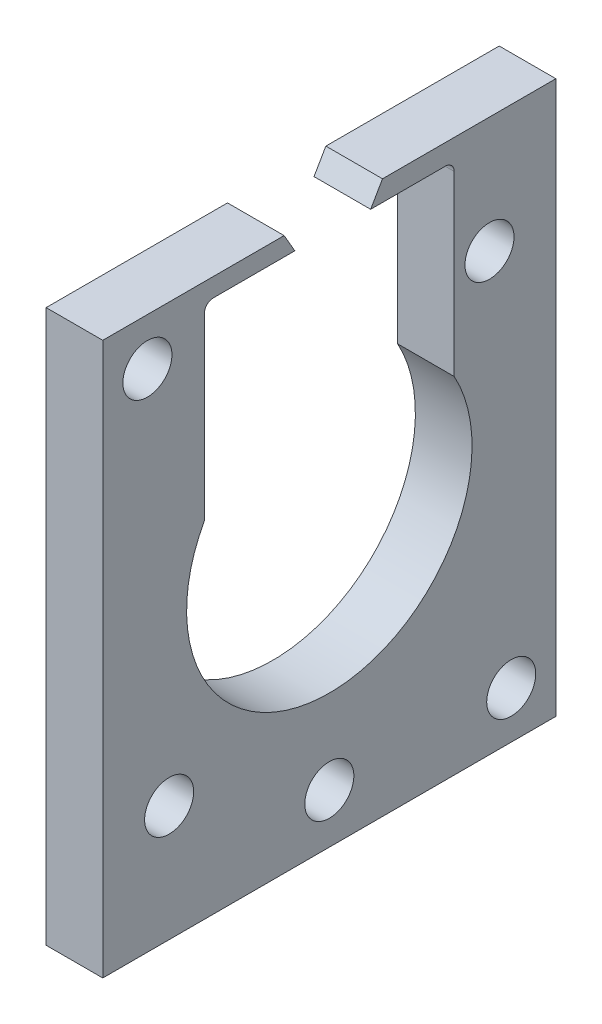
ISO-10303-21;
HEADER;
FILE_DESCRIPTION(('STEP AP214'),'2;1');
FILE_NAME('part.step','',(''),(''),'','','');
FILE_SCHEMA(('AUTOMOTIVE_DESIGN { 1 0 10303 214 1 1 1 1 }'));
ENDSEC;
DATA;
#1=APPLICATION_CONTEXT('core data for automotive mechanical design processes');
#2=APPLICATION_PROTOCOL_DEFINITION('international standard','automotive_design',2000,#1);
#3=PRODUCT_CONTEXT('',#1,'mechanical');
#4=PRODUCT('Part','Part','',(#3));
#5=PRODUCT_RELATED_PRODUCT_CATEGORY('part','',(#4));
#6=PRODUCT_DEFINITION_FORMATION('','',#4);
#7=PRODUCT_DEFINITION_CONTEXT('part definition',#1,'design');
#8=PRODUCT_DEFINITION('design','',#6,#7);
#9=PRODUCT_DEFINITION_SHAPE('','',#8);
#10=(LENGTH_UNIT() NAMED_UNIT(*) SI_UNIT(.MILLI.,.METRE.));
#11=(NAMED_UNIT(*) PLANE_ANGLE_UNIT() SI_UNIT($,.RADIAN.));
#12=(NAMED_UNIT(*) SI_UNIT($,.STERADIAN.) SOLID_ANGLE_UNIT());
#13=UNCERTAINTY_MEASURE_WITH_UNIT(LENGTH_MEASURE(1.E-05),#10,'distance_accuracy_value','');
#14=(GEOMETRIC_REPRESENTATION_CONTEXT(3) GLOBAL_UNCERTAINTY_ASSIGNED_CONTEXT((#13)) GLOBAL_UNIT_ASSIGNED_CONTEXT((#10,
#11,#12)) REPRESENTATION_CONTEXT('',''));
#15=CARTESIAN_POINT('',(0.,0.,0.));
#16=DIRECTION('',(0.,0.,1.));
#17=DIRECTION('',(1.,0.,0.));
#18=AXIS2_PLACEMENT_3D('',#15,#16,#17);
#19=CARTESIAN_POINT('',(6.35,61.92,0.));
#20=DIRECTION('',(0.,-1.,0.));
#21=DIRECTION('',(0.,0.,-1.));
#22=AXIS2_PLACEMENT_3D('',#19,#20,#21);
#23=PLANE('',#22);
#24=DIRECTION('',(0.,0.,1.));
#25=VECTOR('',#24,1.);
#26=CARTESIAN_POINT('',(6.35,61.92,0.));
#27=LINE('',#26,#25);
#28=CARTESIAN_POINT('',(6.35,61.92,-20.3333651982404));
#29=VERTEX_POINT('',#28);
#30=CARTESIAN_POINT('',(6.35,61.92,0.));
#31=VERTEX_POINT('',#30);
#32=EDGE_CURVE('E208',#29,#31,#27,.T.);
#33=ORIENTED_EDGE('',*,*,#32,.F.);
#34=DIRECTION('',(-1.,0.,0.));
#35=VECTOR('',#34,1.);
#36=CARTESIAN_POINT('',(6.35,61.92,-20.3333651982404));
#37=LINE('',#36,#35);
#38=CARTESIAN_POINT('',(0.,61.92,-20.3333651982404));
#39=VERTEX_POINT('',#38);
#40=EDGE_CURVE('E190',#29,#39,#37,.T.);
#41=ORIENTED_EDGE('',*,*,#40,.T.);
#42=DIRECTION('',(0.,0.,1.));
#43=VECTOR('',#42,1.);
#44=CARTESIAN_POINT('',(0.,61.92,0.));
#45=LINE('',#44,#43);
#46=CARTESIAN_POINT('',(0.,61.92,0.));
#47=VERTEX_POINT('',#46);
#48=EDGE_CURVE('E219',#39,#47,#45,.T.);
#49=ORIENTED_EDGE('',*,*,#48,.T.);
#50=DIRECTION('',(-1.,0.,0.));
#51=VECTOR('',#50,1.);
#52=CARTESIAN_POINT('',(6.35,61.92,0.));
#53=LINE('',#52,#51);
#54=EDGE_CURVE('E212',#31,#47,#53,.T.);
#55=ORIENTED_EDGE('',*,*,#54,.F.);
#56=EDGE_LOOP('',(#33,#41,#49,#55));
#57=FACE_BOUND('',#56,.T.);
#58=ADVANCED_FACE('F39',(#57),#23,.F.);
#59=CARTESIAN_POINT('',(6.35,0.,0.));
#60=DIRECTION('',(0.,0.,-1.));
#61=DIRECTION('',(-1.,0.,0.));
#62=AXIS2_PLACEMENT_3D('',#59,#60,#61);
#63=PLANE('',#62);
#64=DIRECTION('',(0.,-1.,0.));
#65=VECTOR('',#64,1.);
#66=CARTESIAN_POINT('',(0.,0.,0.));
#67=LINE('',#66,#65);
#68=CARTESIAN_POINT('',(0.,0.,0.));
#69=VERTEX_POINT('',#68);
#70=EDGE_CURVE('E197',#47,#69,#67,.T.);
#71=ORIENTED_EDGE('',*,*,#70,.T.);
#72=DIRECTION('',(-1.,0.,0.));
#73=VECTOR('',#72,1.);
#74=CARTESIAN_POINT('',(6.35,0.,0.));
#75=LINE('',#74,#73);
#76=CARTESIAN_POINT('',(6.35,0.,0.));
#77=VERTEX_POINT('',#76);
#78=EDGE_CURVE('E229',#77,#69,#75,.T.);
#79=ORIENTED_EDGE('',*,*,#78,.F.);
#80=DIRECTION('',(0.,-1.,0.));
#81=VECTOR('',#80,1.);
#82=CARTESIAN_POINT('',(6.35,0.,0.));
#83=LINE('',#82,#81);
#84=EDGE_CURVE('E200',#31,#77,#83,.T.);
#85=ORIENTED_EDGE('',*,*,#84,.F.);
#86=ORIENTED_EDGE('',*,*,#54,.T.);
#87=EDGE_LOOP('',(#71,#79,#85,#86));
#88=FACE_BOUND('',#87,.T.);
#89=ADVANCED_FACE('F269',(#88),#63,.F.);
#90=CARTESIAN_POINT('',(6.35,0.,0.));
#91=DIRECTION('',(0.,1.,0.));
#92=DIRECTION('',(0.,0.,1.));
#93=AXIS2_PLACEMENT_3D('',#90,#91,#92);
#94=PLANE('',#93);
#95=DIRECTION('',(0.,0.,-1.));
#96=VECTOR('',#95,1.);
#97=CARTESIAN_POINT('',(0.,0.,0.));
#98=LINE('',#97,#96);
#99=CARTESIAN_POINT('',(0.,0.,-50.8));
#100=VERTEX_POINT('',#99);
#101=EDGE_CURVE('E215',#69,#100,#98,.T.);
#102=ORIENTED_EDGE('',*,*,#101,.T.);
#103=DIRECTION('',(-1.,0.,0.));
#104=VECTOR('',#103,1.);
#105=CARTESIAN_POINT('',(6.35,0.,-50.8));
#106=LINE('',#105,#104);
#107=CARTESIAN_POINT('',(6.35,0.,-50.8));
#108=VERTEX_POINT('',#107);
#109=EDGE_CURVE('E226',#108,#100,#106,.T.);
#110=ORIENTED_EDGE('',*,*,#109,.F.);
#111=DIRECTION('',(0.,0.,-1.));
#112=VECTOR('',#111,1.);
#113=CARTESIAN_POINT('',(6.35,0.,0.));
#114=LINE('',#113,#112);
#115=EDGE_CURVE('E203',#77,#108,#114,.T.);
#116=ORIENTED_EDGE('',*,*,#115,.F.);
#117=ORIENTED_EDGE('',*,*,#78,.T.);
#118=EDGE_LOOP('',(#102,#110,#116,#117));
#119=FACE_BOUND('',#118,.T.);
#120=ADVANCED_FACE('F278',(#119),#94,.F.);
#121=CARTESIAN_POINT('',(6.35,0.,-50.8));
#122=DIRECTION('',(0.,0.,1.));
#123=DIRECTION('',(1.,0.,0.));
#124=AXIS2_PLACEMENT_3D('',#121,#122,#123);
#125=PLANE('',#124);
#126=DIRECTION('',(0.,1.,0.));
#127=VECTOR('',#126,1.);
#128=CARTESIAN_POINT('',(0.,0.,-50.8));
#129=LINE('',#128,#127);
#130=CARTESIAN_POINT('',(0.,61.92,-50.8));
#131=VERTEX_POINT('',#130);
#132=EDGE_CURVE('E217',#100,#131,#129,.T.);
#133=ORIENTED_EDGE('',*,*,#132,.T.);
#134=DIRECTION('',(-1.,0.,0.));
#135=VECTOR('',#134,1.);
#136=CARTESIAN_POINT('',(6.35,61.92,-50.8));
#137=LINE('',#136,#135);
#138=CARTESIAN_POINT('',(6.35,61.92,-50.8));
#139=VERTEX_POINT('',#138);
#140=EDGE_CURVE('E223',#139,#131,#137,.T.);
#141=ORIENTED_EDGE('',*,*,#140,.F.);
#142=DIRECTION('',(0.,1.,0.));
#143=VECTOR('',#142,1.);
#144=CARTESIAN_POINT('',(6.35,0.,-50.8));
#145=LINE('',#144,#143);
#146=EDGE_CURVE('E206',#108,#139,#145,.T.);
#147=ORIENTED_EDGE('',*,*,#146,.F.);
#148=ORIENTED_EDGE('',*,*,#109,.T.);
#149=EDGE_LOOP('',(#133,#141,#147,#148));
#150=FACE_BOUND('',#149,.T.);
#151=ADVANCED_FACE('F283',(#150),#125,.F.);
#152=CARTESIAN_POINT('',(0.,61.92,-31.362590431548));
#153=VERTEX_POINT('',#152);
#154=EDGE_CURVE('E204',#131,#153,#45,.T.);
#155=ORIENTED_EDGE('',*,*,#154,.T.);
#156=DIRECTION('',(1.,0.,0.));
#157=VECTOR('',#156,1.);
#158=CARTESIAN_POINT('',(6.35,61.92,-31.362590431548));
#159=LINE('',#158,#157);
#160=CARTESIAN_POINT('',(6.35,61.92,-31.362590431548));
#161=VERTEX_POINT('',#160);
#162=EDGE_CURVE('E167',#153,#161,#159,.T.);
#163=ORIENTED_EDGE('',*,*,#162,.T.);
#164=EDGE_CURVE('E209',#139,#161,#27,.T.);
#165=ORIENTED_EDGE('',*,*,#164,.F.);
#166=ORIENTED_EDGE('',*,*,#140,.T.);
#167=EDGE_LOOP('',(#155,#163,#165,#166));
#168=FACE_BOUND('',#167,.T.);
#169=ADVANCED_FACE('F272',(#168),#23,.F.);
#170=CARTESIAN_POINT('',(6.35,0.,0.));
#171=DIRECTION('',(-1.,0.,0.));
#172=DIRECTION('',(0.,0.,1.));
#173=AXIS2_PLACEMENT_3D('',#170,#171,#172);
#174=PLANE('',#173);
#175=CARTESIAN_POINT('',(6.35,56.6480871347204,-5.00450452609221));
#176=DIRECTION('',(-1.,0.,0.));
#177=DIRECTION('',(0.,0.,1.));
#178=AXIS2_PLACEMENT_3D('',#175,#176,#177);
#179=CIRCLE('',#178,2.75);
#180=CARTESIAN_POINT('',(6.35,56.6480871347204,-2.25450452609221));
#181=VERTEX_POINT('',#180);
#182=EDGE_CURVE('E328',#181,#181,#179,.F.);
#183=ORIENTED_EDGE('',*,*,#182,.F.);
#184=EDGE_LOOP('',(#183));
#185=FACE_BOUND('',#184,.T.);
#186=CARTESIAN_POINT('',(6.35,48.9207559055119,-43.3599239801062));
#187=DIRECTION('',(-1.,0.,0.));
#188=DIRECTION('',(0.,0.,1.));
#189=AXIS2_PLACEMENT_3D('',#186,#187,#188);
#190=CIRCLE('',#189,2.75);
#191=CARTESIAN_POINT('',(6.35,48.9207559055119,-40.6099239801062));
#192=VERTEX_POINT('',#191);
#193=EDGE_CURVE('E327',#192,#192,#190,.F.);
#194=ORIENTED_EDGE('',*,*,#193,.F.);
#195=EDGE_LOOP('',(#194));
#196=FACE_BOUND('',#195,.T.);
#197=CARTESIAN_POINT('',(6.35,13.0001827578617,-7.439487757862));
#198=DIRECTION('',(-1.,0.,0.));
#199=DIRECTION('',(0.,0.,1.));
#200=AXIS2_PLACEMENT_3D('',#197,#198,#199);
#201=CIRCLE('',#200,2.75);
#202=CARTESIAN_POINT('',(6.35,13.0001827578617,-4.689487757862));
#203=VERTEX_POINT('',#202);
#204=EDGE_CURVE('E334',#203,#203,#201,.F.);
#205=ORIENTED_EDGE('',*,*,#204,.F.);
#206=EDGE_LOOP('',(#205));
#207=FACE_BOUND('',#206,.T.);
#208=CARTESIAN_POINT('',(6.35,5.56069500000003,-25.3996554046471));
#209=DIRECTION('',(-1.,0.,0.));
#210=DIRECTION('',(0.,0.,1.));
#211=AXIS2_PLACEMENT_3D('',#208,#209,#210);
#212=CIRCLE('',#211,2.75);
#213=CARTESIAN_POINT('',(6.35,5.56069500000003,-22.6496554046471));
#214=VERTEX_POINT('',#213);
#215=EDGE_CURVE('E340',#214,#214,#212,.F.);
#216=ORIENTED_EDGE('',*,*,#215,.F.);
#217=EDGE_LOOP('',(#216));
#218=FACE_BOUND('',#217,.T.);
#219=CARTESIAN_POINT('',(6.35,5.27247112124192,-45.7955093976272));
#220=DIRECTION('',(-1.,0.,0.));
#221=DIRECTION('',(0.,0.,1.));
#222=AXIS2_PLACEMENT_3D('',#219,#220,#221);
#223=CIRCLE('',#222,2.75);
#224=CARTESIAN_POINT('',(6.35,5.27247112124192,-43.0455093976272));
#225=VERTEX_POINT('',#224);
#226=EDGE_CURVE('E176',#225,#225,#223,.F.);
#227=ORIENTED_EDGE('',*,*,#226,.F.);
#228=EDGE_LOOP('',(#227));
#229=FACE_BOUND('',#228,.T.);
#230=ORIENTED_EDGE('',*,*,#164,.T.);
#231=DIRECTION('',(0.,0.866025403784437,-0.500000000000003));
#232=VECTOR('',#231,1.);
#233=CARTESIAN_POINT('',(6.35,59.62,-30.0346848124119));
#234=LINE('',#233,#232);
#235=CARTESIAN_POINT('',(6.35,59.62,-30.0346848124119));
#236=VERTEX_POINT('',#235);
#237=EDGE_CURVE('E182',#236,#161,#234,.T.);
#238=ORIENTED_EDGE('',*,*,#237,.F.);
#239=DIRECTION('',(0.,0.,1.));
#240=VECTOR('',#239,1.);
#241=CARTESIAN_POINT('',(6.35,59.62,-39.4));
#242=LINE('',#241,#240);
#243=CARTESIAN_POINT('',(6.35,59.62,-38.4));
#244=VERTEX_POINT('',#243);
#245=EDGE_CURVE('E159',#244,#236,#242,.T.);
#246=ORIENTED_EDGE('',*,*,#245,.F.);
#247=CARTESIAN_POINT('',(6.35,58.62,-38.4));
#248=DIRECTION('',(-1.,0.,0.));
#249=DIRECTION('',(0.,0.,1.));
#250=AXIS2_PLACEMENT_3D('',#247,#248,#249);
#251=CIRCLE('',#250,1.);
#252=CARTESIAN_POINT('',(6.35,58.62,-39.4));
#253=VERTEX_POINT('',#252);
#254=EDGE_CURVE('E246',#244,#253,#251,.T.);
#255=ORIENTED_EDGE('',*,*,#254,.T.);
#256=DIRECTION('',(0.,1.,0.));
#257=VECTOR('',#256,1.);
#258=CARTESIAN_POINT('',(6.35,37.92,-39.4));
#259=LINE('',#258,#257);
#260=CARTESIAN_POINT('',(6.35,38.7066616924153,-39.4));
#261=VERTEX_POINT('',#260);
#262=EDGE_CURVE('E178',#261,#253,#259,.T.);
#263=ORIENTED_EDGE('',*,*,#262,.F.);
#264=CARTESIAN_POINT('',(6.35,30.9606949999999,-25.4000000000003));
#265=DIRECTION('',(-1.,0.,0.));
#266=DIRECTION('',(0.,0.,1.));
#267=AXIS2_PLACEMENT_3D('',#264,#265,#266);
#268=CIRCLE('',#267,16.);
#269=CARTESIAN_POINT('',(6.35,38.7066616924142,-11.4));
#270=VERTEX_POINT('',#269);
#271=EDGE_CURVE('E194',#261,#270,#268,.T.);
#272=ORIENTED_EDGE('',*,*,#271,.T.);
#273=DIRECTION('',(0.,-1.,0.));
#274=VECTOR('',#273,1.);
#275=CARTESIAN_POINT('',(6.35,59.839253392126,-11.4));
#276=LINE('',#275,#274);
#277=CARTESIAN_POINT('',(6.35,58.839253392126,-11.4));
#278=VERTEX_POINT('',#277);
#279=EDGE_CURVE('E175',#278,#270,#276,.T.);
#280=ORIENTED_EDGE('',*,*,#279,.F.);
#281=CARTESIAN_POINT('',(6.35,58.839253392126,-12.4));
#282=DIRECTION('',(-1.,0.,0.));
#283=DIRECTION('',(0.,0.,1.));
#284=AXIS2_PLACEMENT_3D('',#281,#282,#283);
#285=CIRCLE('',#284,1.);
#286=CARTESIAN_POINT('',(6.35,59.839253392126,-12.4));
#287=VERTEX_POINT('',#286);
#288=EDGE_CURVE('E47',#278,#287,#285,.T.);
#289=ORIENTED_EDGE('',*,*,#288,.T.);
#290=DIRECTION('',(0.,0.,1.));
#291=VECTOR('',#290,1.);
#292=CARTESIAN_POINT('',(6.35,59.839253392126,-11.4));
#293=LINE('',#292,#291);
#294=CARTESIAN_POINT('',(6.35,59.839253392126,-21.5346848124119));
#295=VERTEX_POINT('',#294);
#296=EDGE_CURVE('E173',#295,#287,#293,.T.);
#297=ORIENTED_EDGE('',*,*,#296,.F.);
#298=DIRECTION('',(0.,-0.866025403784436,-0.500000000000004));
#299=VECTOR('',#298,1.);
#300=CARTESIAN_POINT('',(6.35,59.839253392126,-21.5346848124119));
#301=LINE('',#300,#299);
#302=EDGE_CURVE('E184',#29,#295,#301,.T.);
#303=ORIENTED_EDGE('',*,*,#302,.F.);
#304=ORIENTED_EDGE('',*,*,#32,.T.);
#305=ORIENTED_EDGE('',*,*,#84,.T.);
#306=ORIENTED_EDGE('',*,*,#115,.T.);
#307=ORIENTED_EDGE('',*,*,#146,.T.);
#308=EDGE_LOOP('',(#230,#238,#246,#255,#263,#272,#280,#289,#297,#303,#304,#305,#306,#307));
#309=FACE_BOUND('',#308,.T.);
#310=ADVANCED_FACE('F249',(#185,#196,#207,#218,#229,#309),#174,.F.);
#311=CARTESIAN_POINT('',(0.,0.,0.));
#312=DIRECTION('',(-1.,0.,0.));
#313=DIRECTION('',(0.,0.,1.));
#314=AXIS2_PLACEMENT_3D('',#311,#312,#313);
#315=PLANE('',#314);
#316=CARTESIAN_POINT('',(0.,56.6480871347204,-5.00450452609221));
#317=DIRECTION('',(-1.,0.,0.));
#318=DIRECTION('',(0.,0.,1.));
#319=AXIS2_PLACEMENT_3D('',#316,#317,#318);
#320=CIRCLE('',#319,2.75);
#321=CARTESIAN_POINT('',(0.,56.6480871347204,-2.25450452609221));
#322=VERTEX_POINT('',#321);
#323=EDGE_CURVE('E324',#322,#322,#320,.T.);
#324=ORIENTED_EDGE('',*,*,#323,.F.);
#325=EDGE_LOOP('',(#324));
#326=FACE_BOUND('',#325,.T.);
#327=CARTESIAN_POINT('',(0.,48.9207559055119,-43.3599239801062));
#328=DIRECTION('',(-1.,0.,0.));
#329=DIRECTION('',(0.,0.,1.));
#330=AXIS2_PLACEMENT_3D('',#327,#328,#329);
#331=CIRCLE('',#330,2.75);
#332=CARTESIAN_POINT('',(0.,48.9207559055119,-40.6099239801062));
#333=VERTEX_POINT('',#332);
#334=EDGE_CURVE('E331',#333,#333,#331,.T.);
#335=ORIENTED_EDGE('',*,*,#334,.F.);
#336=EDGE_LOOP('',(#335));
#337=FACE_BOUND('',#336,.T.);
#338=CARTESIAN_POINT('',(0.,13.0001827578617,-7.439487757862));
#339=DIRECTION('',(-1.,0.,0.));
#340=DIRECTION('',(0.,0.,1.));
#341=AXIS2_PLACEMENT_3D('',#338,#339,#340);
#342=CIRCLE('',#341,2.75);
#343=CARTESIAN_POINT('',(0.,13.0001827578617,-4.689487757862));
#344=VERTEX_POINT('',#343);
#345=EDGE_CURVE('E337',#344,#344,#342,.T.);
#346=ORIENTED_EDGE('',*,*,#345,.F.);
#347=EDGE_LOOP('',(#346));
#348=FACE_BOUND('',#347,.T.);
#349=CARTESIAN_POINT('',(0.,5.56069500000003,-25.3996554046471));
#350=DIRECTION('',(-1.,0.,0.));
#351=DIRECTION('',(0.,0.,1.));
#352=AXIS2_PLACEMENT_3D('',#349,#350,#351);
#353=CIRCLE('',#352,2.75);
#354=CARTESIAN_POINT('',(0.,5.56069500000003,-22.6496554046471));
#355=VERTEX_POINT('',#354);
#356=EDGE_CURVE('E323',#355,#355,#353,.T.);
#357=ORIENTED_EDGE('',*,*,#356,.F.);
#358=EDGE_LOOP('',(#357));
#359=FACE_BOUND('',#358,.T.);
#360=CARTESIAN_POINT('',(0.,5.27247112124192,-45.7955093976272));
#361=DIRECTION('',(-1.,0.,0.));
#362=DIRECTION('',(0.,0.,1.));
#363=AXIS2_PLACEMENT_3D('',#360,#361,#362);
#364=CIRCLE('',#363,2.75);
#365=CARTESIAN_POINT('',(0.,5.27247112124192,-43.0455093976272));
#366=VERTEX_POINT('',#365);
#367=EDGE_CURVE('E320',#366,#366,#364,.T.);
#368=ORIENTED_EDGE('',*,*,#367,.F.);
#369=EDGE_LOOP('',(#368));
#370=FACE_BOUND('',#369,.T.);
#371=DIRECTION('',(0.,0.866025403784437,-0.500000000000003));
#372=VECTOR('',#371,1.);
#373=CARTESIAN_POINT('',(0.,59.62,-30.0346848124119));
#374=LINE('',#373,#372);
#375=CARTESIAN_POINT('',(0.,59.62,-30.0346848124119));
#376=VERTEX_POINT('',#375);
#377=EDGE_CURVE('E145',#376,#153,#374,.T.);
#378=ORIENTED_EDGE('',*,*,#377,.T.);
#379=ORIENTED_EDGE('',*,*,#154,.F.);
#380=ORIENTED_EDGE('',*,*,#132,.F.);
#381=ORIENTED_EDGE('',*,*,#101,.F.);
#382=ORIENTED_EDGE('',*,*,#70,.F.);
#383=ORIENTED_EDGE('',*,*,#48,.F.);
#384=DIRECTION('',(0.,-0.866025403784436,-0.500000000000004));
#385=VECTOR('',#384,1.);
#386=CARTESIAN_POINT('',(0.,59.839253392126,-21.5346848124119));
#387=LINE('',#386,#385);
#388=CARTESIAN_POINT('',(0.,59.839253392126,-21.5346848124119));
#389=VERTEX_POINT('',#388);
#390=EDGE_CURVE('E163',#39,#389,#387,.T.);
#391=ORIENTED_EDGE('',*,*,#390,.T.);
#392=DIRECTION('',(0.,0.,1.));
#393=VECTOR('',#392,1.);
#394=CARTESIAN_POINT('',(0.,59.839253392126,-11.4));
#395=LINE('',#394,#393);
#396=CARTESIAN_POINT('',(0.,59.839253392126,-12.4));
#397=VERTEX_POINT('',#396);
#398=EDGE_CURVE('E186',#389,#397,#395,.T.);
#399=ORIENTED_EDGE('',*,*,#398,.T.);
#400=CARTESIAN_POINT('',(0.,58.839253392126,-12.4));
#401=DIRECTION('',(-1.,0.,0.));
#402=DIRECTION('',(0.,0.,1.));
#403=AXIS2_PLACEMENT_3D('',#400,#401,#402);
#404=CIRCLE('',#403,1.);
#405=CARTESIAN_POINT('',(0.,58.839253392126,-11.4));
#406=VERTEX_POINT('',#405);
#407=EDGE_CURVE('E11',#397,#406,#404,.F.);
#408=ORIENTED_EDGE('',*,*,#407,.T.);
#409=DIRECTION('',(0.,-1.,0.));
#410=VECTOR('',#409,1.);
#411=CARTESIAN_POINT('',(0.,59.839253392126,-11.4));
#412=LINE('',#411,#410);
#413=CARTESIAN_POINT('',(0.,38.7066616924142,-11.4));
#414=VERTEX_POINT('',#413);
#415=EDGE_CURVE('E311',#406,#414,#412,.T.);
#416=ORIENTED_EDGE('',*,*,#415,.T.);
#417=CARTESIAN_POINT('',(0.,30.9606949999999,-25.4000000000003));
#418=DIRECTION('',(-1.,0.,0.));
#419=DIRECTION('',(0.,0.,1.));
#420=AXIS2_PLACEMENT_3D('',#417,#418,#419);
#421=CIRCLE('',#420,16.);
#422=CARTESIAN_POINT('',(0.,38.7066616924153,-39.4));
#423=VERTEX_POINT('',#422);
#424=EDGE_CURVE('E193',#423,#414,#421,.T.);
#425=ORIENTED_EDGE('',*,*,#424,.F.);
#426=DIRECTION('',(0.,1.,0.));
#427=VECTOR('',#426,1.);
#428=CARTESIAN_POINT('',(0.,37.92,-39.4));
#429=LINE('',#428,#427);
#430=CARTESIAN_POINT('',(0.,58.62,-39.4));
#431=VERTEX_POINT('',#430);
#432=EDGE_CURVE('E153',#423,#431,#429,.T.);
#433=ORIENTED_EDGE('',*,*,#432,.T.);
#434=CARTESIAN_POINT('',(0.,58.62,-38.4));
#435=DIRECTION('',(-1.,0.,0.));
#436=DIRECTION('',(0.,0.,1.));
#437=AXIS2_PLACEMENT_3D('',#434,#435,#436);
#438=CIRCLE('',#437,1.);
#439=CARTESIAN_POINT('',(0.,59.62,-38.4));
#440=VERTEX_POINT('',#439);
#441=EDGE_CURVE('E149',#431,#440,#438,.F.);
#442=ORIENTED_EDGE('',*,*,#441,.T.);
#443=DIRECTION('',(0.,0.,1.));
#444=VECTOR('',#443,1.);
#445=CARTESIAN_POINT('',(0.,59.62,-39.4));
#446=LINE('',#445,#444);
#447=EDGE_CURVE('E140',#440,#376,#446,.T.);
#448=ORIENTED_EDGE('',*,*,#447,.T.);
#449=EDGE_LOOP('',(#378,#379,#380,#381,#382,#383,#391,#399,#408,#416,#425,#433,#442,#448));
#450=FACE_BOUND('',#449,.T.);
#451=ADVANCED_FACE('F142',(#326,#337,#348,#359,#370,#450),#315,.T.);
#452=CARTESIAN_POINT('',(6.35,30.9606949999999,-25.4000000000003));
#453=DIRECTION('',(-1.,0.,0.));
#454=DIRECTION('',(0.,0.,1.));
#455=AXIS2_PLACEMENT_3D('',#452,#453,#454);
#456=CYLINDRICAL_SURFACE('',#455,16.);
#457=ORIENTED_EDGE('',*,*,#271,.F.);
#458=DIRECTION('',(-1.,0.,0.));
#459=VECTOR('',#458,1.);
#460=CARTESIAN_POINT('',(6.35,38.7066616924153,-39.4));
#461=LINE('',#460,#459);
#462=EDGE_CURVE('E235',#261,#423,#461,.T.);
#463=ORIENTED_EDGE('',*,*,#462,.T.);
#464=ORIENTED_EDGE('',*,*,#424,.T.);
#465=DIRECTION('',(-1.,0.,0.));
#466=VECTOR('',#465,1.);
#467=CARTESIAN_POINT('',(6.35,38.7066616924142,-11.4));
#468=LINE('',#467,#466);
#469=EDGE_CURVE('E232',#414,#270,#468,.F.);
#470=ORIENTED_EDGE('',*,*,#469,.T.);
#471=EDGE_LOOP('',(#457,#463,#464,#470));
#472=FACE_BOUND('',#471,.T.);
#473=ADVANCED_FACE('F374',(#472),#456,.F.);
#474=CARTESIAN_POINT('',(0.,59.839253392126,-11.4));
#475=DIRECTION('',(0.,0.,1.));
#476=DIRECTION('',(0.,-1.,0.));
#477=AXIS2_PLACEMENT_3D('',#474,#475,#476);
#478=PLANE('',#477);
#479=ORIENTED_EDGE('',*,*,#415,.F.);
#480=DIRECTION('',(1.,0.,0.));
#481=VECTOR('',#480,1.);
#482=CARTESIAN_POINT('',(6.35,58.839253392126,-11.4));
#483=LINE('',#482,#481);
#484=EDGE_CURVE('E242',#406,#278,#483,.T.);
#485=ORIENTED_EDGE('',*,*,#484,.T.);
#486=ORIENTED_EDGE('',*,*,#279,.T.);
#487=ORIENTED_EDGE('',*,*,#469,.F.);
#488=EDGE_LOOP('',(#479,#485,#486,#487));
#489=FACE_BOUND('',#488,.T.);
#490=ADVANCED_FACE('F314',(#489),#478,.F.);
#491=CARTESIAN_POINT('',(0.,59.839253392126,-21.5346848124119));
#492=DIRECTION('',(0.,-0.500000000000004,0.866025403784436));
#493=DIRECTION('',(0.,-0.866025403784436,-0.500000000000004));
#494=AXIS2_PLACEMENT_3D('',#491,#492,#493);
#495=PLANE('',#494);
#496=ORIENTED_EDGE('',*,*,#302,.T.);
#497=DIRECTION('',(1.,0.,0.));
#498=VECTOR('',#497,1.);
#499=CARTESIAN_POINT('',(0.,59.839253392126,-21.5346848124119));
#500=LINE('',#499,#498);
#501=EDGE_CURVE('E162',#389,#295,#500,.T.);
#502=ORIENTED_EDGE('',*,*,#501,.F.);
#503=ORIENTED_EDGE('',*,*,#390,.F.);
#504=ORIENTED_EDGE('',*,*,#40,.F.);
#505=EDGE_LOOP('',(#496,#502,#503,#504));
#506=FACE_BOUND('',#505,.T.);
#507=ADVANCED_FACE('F305',(#506),#495,.F.);
#508=CARTESIAN_POINT('',(0.,59.839253392126,-11.4));
#509=DIRECTION('',(0.,1.,0.));
#510=DIRECTION('',(0.,0.,1.));
#511=AXIS2_PLACEMENT_3D('',#508,#509,#510);
#512=PLANE('',#511);
#513=ORIENTED_EDGE('',*,*,#296,.T.);
#514=DIRECTION('',(1.,0.,0.));
#515=VECTOR('',#514,1.);
#516=CARTESIAN_POINT('',(0.,59.839253392126,-12.4));
#517=LINE('',#516,#515);
#518=EDGE_CURVE('E54',#287,#397,#517,.F.);
#519=ORIENTED_EDGE('',*,*,#518,.T.);
#520=ORIENTED_EDGE('',*,*,#398,.F.);
#521=ORIENTED_EDGE('',*,*,#501,.T.);
#522=EDGE_LOOP('',(#513,#519,#520,#521));
#523=FACE_BOUND('',#522,.T.);
#524=ADVANCED_FACE('F306',(#523),#512,.F.);
#525=CARTESIAN_POINT('',(0.,59.62,-30.0346848124119));
#526=DIRECTION('',(0.,-0.500000000000003,-0.866025403784437));
#527=DIRECTION('',(0.,0.866025403784437,-0.500000000000003));
#528=AXIS2_PLACEMENT_3D('',#525,#526,#527);
#529=PLANE('',#528);
#530=ORIENTED_EDGE('',*,*,#377,.F.);
#531=DIRECTION('',(1.,0.,0.));
#532=VECTOR('',#531,1.);
#533=CARTESIAN_POINT('',(0.,59.62,-30.0346848124119));
#534=LINE('',#533,#532);
#535=EDGE_CURVE('E156',#376,#236,#534,.T.);
#536=ORIENTED_EDGE('',*,*,#535,.T.);
#537=ORIENTED_EDGE('',*,*,#237,.T.);
#538=ORIENTED_EDGE('',*,*,#162,.F.);
#539=EDGE_LOOP('',(#530,#536,#537,#538));
#540=FACE_BOUND('',#539,.T.);
#541=ADVANCED_FACE('F165',(#540),#529,.F.);
#542=CARTESIAN_POINT('',(0.,37.92,-39.4));
#543=DIRECTION('',(0.,0.,-1.));
#544=DIRECTION('',(0.,1.,0.));
#545=AXIS2_PLACEMENT_3D('',#542,#543,#544);
#546=PLANE('',#545);
#547=ORIENTED_EDGE('',*,*,#262,.T.);
#548=DIRECTION('',(1.,0.,0.));
#549=VECTOR('',#548,1.);
#550=CARTESIAN_POINT('',(0.,58.62,-39.4));
#551=LINE('',#550,#549);
#552=EDGE_CURVE('E240',#253,#431,#551,.F.);
#553=ORIENTED_EDGE('',*,*,#552,.T.);
#554=ORIENTED_EDGE('',*,*,#432,.F.);
#555=ORIENTED_EDGE('',*,*,#462,.F.);
#556=EDGE_LOOP('',(#547,#553,#554,#555));
#557=FACE_BOUND('',#556,.T.);
#558=ADVANCED_FACE('F254',(#557),#546,.F.);
#559=CARTESIAN_POINT('',(0.,59.62,-39.4));
#560=DIRECTION('',(0.,1.,0.));
#561=DIRECTION('',(0.,0.,1.));
#562=AXIS2_PLACEMENT_3D('',#559,#560,#561);
#563=PLANE('',#562);
#564=ORIENTED_EDGE('',*,*,#447,.F.);
#565=DIRECTION('',(1.,0.,0.));
#566=VECTOR('',#565,1.);
#567=CARTESIAN_POINT('',(6.35,59.62,-38.4));
#568=LINE('',#567,#566);
#569=EDGE_CURVE('E238',#440,#244,#568,.T.);
#570=ORIENTED_EDGE('',*,*,#569,.T.);
#571=ORIENTED_EDGE('',*,*,#245,.T.);
#572=ORIENTED_EDGE('',*,*,#535,.F.);
#573=EDGE_LOOP('',(#564,#570,#571,#572));
#574=FACE_BOUND('',#573,.T.);
#575=ADVANCED_FACE('F157',(#574),#563,.F.);
#576=CARTESIAN_POINT('',(6.351,5.27247112124192,-45.7955093976272));
#577=DIRECTION('',(-1.,0.,0.));
#578=DIRECTION('',(0.,0.,1.));
#579=AXIS2_PLACEMENT_3D('',#576,#577,#578);
#580=CYLINDRICAL_SURFACE('',#579,2.75);
#581=ORIENTED_EDGE('',*,*,#367,.T.);
#582=EDGE_LOOP('',(#581));
#583=FACE_BOUND('',#582,.T.);
#584=ORIENTED_EDGE('',*,*,#226,.T.);
#585=EDGE_LOOP('',(#584));
#586=FACE_BOUND('',#585,.T.);
#587=ADVANCED_FACE('F353',(#583,#586),#580,.F.);
#588=CARTESIAN_POINT('',(6.351,5.56069500000003,-25.3996554046471));
#589=DIRECTION('',(-1.,0.,0.));
#590=DIRECTION('',(0.,0.,1.));
#591=AXIS2_PLACEMENT_3D('',#588,#589,#590);
#592=CYLINDRICAL_SURFACE('',#591,2.75);
#593=ORIENTED_EDGE('',*,*,#356,.T.);
#594=EDGE_LOOP('',(#593));
#595=FACE_BOUND('',#594,.T.);
#596=ORIENTED_EDGE('',*,*,#215,.T.);
#597=EDGE_LOOP('',(#596));
#598=FACE_BOUND('',#597,.T.);
#599=ADVANCED_FACE('F348',(#595,#598),#592,.F.);
#600=CARTESIAN_POINT('',(6.351,13.0001827578617,-7.439487757862));
#601=DIRECTION('',(-1.,0.,0.));
#602=DIRECTION('',(0.,0.,1.));
#603=AXIS2_PLACEMENT_3D('',#600,#601,#602);
#604=CYLINDRICAL_SURFACE('',#603,2.75);
#605=ORIENTED_EDGE('',*,*,#345,.T.);
#606=EDGE_LOOP('',(#605));
#607=FACE_BOUND('',#606,.T.);
#608=ORIENTED_EDGE('',*,*,#204,.T.);
#609=EDGE_LOOP('',(#608));
#610=FACE_BOUND('',#609,.T.);
#611=ADVANCED_FACE('F361',(#607,#610),#604,.F.);
#612=CARTESIAN_POINT('',(6.351,48.9207559055119,-43.3599239801062));
#613=DIRECTION('',(-1.,0.,0.));
#614=DIRECTION('',(0.,0.,1.));
#615=AXIS2_PLACEMENT_3D('',#612,#613,#614);
#616=CYLINDRICAL_SURFACE('',#615,2.75);
#617=ORIENTED_EDGE('',*,*,#334,.T.);
#618=EDGE_LOOP('',(#617));
#619=FACE_BOUND('',#618,.T.);
#620=ORIENTED_EDGE('',*,*,#193,.T.);
#621=EDGE_LOOP('',(#620));
#622=FACE_BOUND('',#621,.T.);
#623=ADVANCED_FACE('F264',(#619,#622),#616,.F.);
#624=CARTESIAN_POINT('',(6.351,56.6480871347204,-5.00450452609221));
#625=DIRECTION('',(-1.,0.,0.));
#626=DIRECTION('',(0.,0.,1.));
#627=AXIS2_PLACEMENT_3D('',#624,#625,#626);
#628=CYLINDRICAL_SURFACE('',#627,2.75);
#629=ORIENTED_EDGE('',*,*,#323,.T.);
#630=EDGE_LOOP('',(#629));
#631=FACE_BOUND('',#630,.T.);
#632=ORIENTED_EDGE('',*,*,#182,.T.);
#633=EDGE_LOOP('',(#632));
#634=FACE_BOUND('',#633,.T.);
#635=ADVANCED_FACE('F257',(#631,#634),#628,.F.);
#636=CARTESIAN_POINT('',(0.,58.62,-38.4));
#637=DIRECTION('',(-1.,0.,0.));
#638=DIRECTION('',(0.,0.,1.));
#639=AXIS2_PLACEMENT_3D('',#636,#637,#638);
#640=CYLINDRICAL_SURFACE('',#639,1.);
#641=ORIENTED_EDGE('',*,*,#441,.F.);
#642=ORIENTED_EDGE('',*,*,#552,.F.);
#643=ORIENTED_EDGE('',*,*,#254,.F.);
#644=ORIENTED_EDGE('',*,*,#569,.F.);
#645=EDGE_LOOP('',(#641,#642,#643,#644));
#646=FACE_BOUND('',#645,.T.);
#647=ADVANCED_FACE('F255',(#646),#640,.F.);
#648=CARTESIAN_POINT('',(0.,58.839253392126,-12.4));
#649=DIRECTION('',(-1.,0.,0.));
#650=DIRECTION('',(0.,0.,1.));
#651=AXIS2_PLACEMENT_3D('',#648,#649,#650);
#652=CYLINDRICAL_SURFACE('',#651,1.);
#653=ORIENTED_EDGE('',*,*,#407,.F.);
#654=ORIENTED_EDGE('',*,*,#518,.F.);
#655=ORIENTED_EDGE('',*,*,#288,.F.);
#656=ORIENTED_EDGE('',*,*,#484,.F.);
#657=EDGE_LOOP('',(#653,#654,#655,#656));
#658=FACE_BOUND('',#657,.T.);
#659=ADVANCED_FACE('F41',(#658),#652,.F.);
#660=CLOSED_SHELL('',(#58,#89,#120,#151,#169,#310,#451,#473,#490,#507,#524,#541,#558,#575,#587,
#599,#611,#623,#635,#647,#659));
#661=MANIFOLD_SOLID_BREP('B2',#660);
#662=ADVANCED_BREP_SHAPE_REPRESENTATION('',(#18,#661),#14);
#663=SHAPE_DEFINITION_REPRESENTATION(#9,#662);
ENDSEC;
END-ISO-10303-21;
